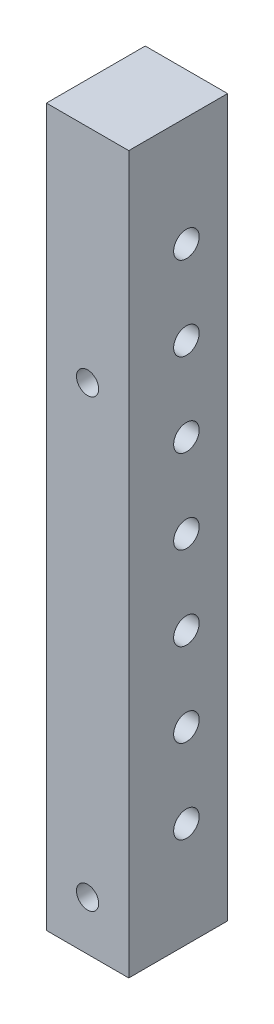
ISO-10303-21;
HEADER;
FILE_DESCRIPTION(('STEP AP214'),'2;1');
FILE_NAME('part.step','',(''),(''),'','','');
FILE_SCHEMA(('AUTOMOTIVE_DESIGN { 1 0 10303 214 1 1 1 1 }'));
ENDSEC;
DATA;
#1=APPLICATION_CONTEXT('core data for automotive mechanical design processes');
#2=APPLICATION_PROTOCOL_DEFINITION('international standard','automotive_design',2000,#1);
#3=PRODUCT_CONTEXT('',#1,'mechanical');
#4=PRODUCT('Part','Part','',(#3));
#5=PRODUCT_RELATED_PRODUCT_CATEGORY('part','',(#4));
#6=PRODUCT_DEFINITION_FORMATION('','',#4);
#7=PRODUCT_DEFINITION_CONTEXT('part definition',#1,'design');
#8=PRODUCT_DEFINITION('design','',#6,#7);
#9=PRODUCT_DEFINITION_SHAPE('','',#8);
#10=(LENGTH_UNIT() NAMED_UNIT(*) SI_UNIT(.MILLI.,.METRE.));
#11=(NAMED_UNIT(*) PLANE_ANGLE_UNIT() SI_UNIT($,.RADIAN.));
#12=(NAMED_UNIT(*) SI_UNIT($,.STERADIAN.) SOLID_ANGLE_UNIT());
#13=UNCERTAINTY_MEASURE_WITH_UNIT(LENGTH_MEASURE(1.E-05),#10,'distance_accuracy_value','');
#14=(GEOMETRIC_REPRESENTATION_CONTEXT(3) GLOBAL_UNCERTAINTY_ASSIGNED_CONTEXT((#13)) GLOBAL_UNIT_ASSIGNED_CONTEXT((#10,
#11,#12)) REPRESENTATION_CONTEXT('',''));
#15=CARTESIAN_POINT('',(0.,0.,0.));
#16=DIRECTION('',(0.,0.,1.));
#17=DIRECTION('',(1.,0.,0.));
#18=AXIS2_PLACEMENT_3D('',#15,#16,#17);
#19=CARTESIAN_POINT('',(-5.,0.,-6.));
#20=DIRECTION('',(0.,0.,-1.));
#21=DIRECTION('',(-1.,0.,0.));
#22=AXIS2_PLACEMENT_3D('',#19,#20,#21);
#23=PLANE('',#22);
#24=DIRECTION('',(0.,1.,0.));
#25=VECTOR('',#24,1.);
#26=CARTESIAN_POINT('',(5.,0.,-6.));
#27=LINE('',#26,#25);
#28=CARTESIAN_POINT('',(5.,0.,-6.));
#29=VERTEX_POINT('',#28);
#30=CARTESIAN_POINT('',(5.,87.,-6.));
#31=VERTEX_POINT('',#30);
#32=EDGE_CURVE('E88',#29,#31,#27,.T.);
#33=ORIENTED_EDGE('',*,*,#32,.F.);
#34=DIRECTION('',(1.,0.,0.));
#35=VECTOR('',#34,1.);
#36=CARTESIAN_POINT('',(-5.,0.,-6.));
#37=LINE('',#36,#35);
#38=CARTESIAN_POINT('',(-5.,0.,-6.));
#39=VERTEX_POINT('',#38);
#40=EDGE_CURVE('E83',#39,#29,#37,.T.);
#41=ORIENTED_EDGE('',*,*,#40,.F.);
#42=DIRECTION('',(0.,1.,0.));
#43=VECTOR('',#42,1.);
#44=CARTESIAN_POINT('',(-5.,0.,-6.));
#45=LINE('',#44,#43);
#46=CARTESIAN_POINT('',(-5.,87.,-6.));
#47=VERTEX_POINT('',#46);
#48=EDGE_CURVE('E86',#39,#47,#45,.T.);
#49=ORIENTED_EDGE('',*,*,#48,.T.);
#50=DIRECTION('',(1.,0.,0.));
#51=VECTOR('',#50,1.);
#52=CARTESIAN_POINT('',(-5.,87.,-6.));
#53=LINE('',#52,#51);
#54=EDGE_CURVE('E47',#47,#31,#53,.T.);
#55=ORIENTED_EDGE('',*,*,#54,.T.);
#56=EDGE_LOOP('',(#33,#41,#49,#55));
#57=FACE_BOUND('',#56,.T.);
#58=CARTESIAN_POINT('',(0.,6.,-6.));
#59=DIRECTION('',(0.,0.,1.));
#60=DIRECTION('',(1.,0.,0.));
#61=AXIS2_PLACEMENT_3D('',#58,#59,#60);
#62=CIRCLE('',#61,1.34999999999999);
#63=CARTESIAN_POINT('',(1.34999999999998,6.,-6.));
#64=VERTEX_POINT('',#63);
#65=EDGE_CURVE('E249',#64,#64,#62,.T.);
#66=ORIENTED_EDGE('',*,*,#65,.T.);
#67=EDGE_LOOP('',(#66));
#68=FACE_BOUND('',#67,.T.);
#69=CARTESIAN_POINT('',(0.,60.1,-6.));
#70=DIRECTION('',(0.,0.,1.));
#71=DIRECTION('',(1.,0.,0.));
#72=AXIS2_PLACEMENT_3D('',#69,#70,#71);
#73=CIRCLE('',#72,1.34999999999999);
#74=CARTESIAN_POINT('',(1.34999999999998,60.1,-6.));
#75=VERTEX_POINT('',#74);
#76=EDGE_CURVE('E255',#75,#75,#73,.T.);
#77=ORIENTED_EDGE('',*,*,#76,.T.);
#78=EDGE_LOOP('',(#77));
#79=FACE_BOUND('',#78,.T.);
#80=ADVANCED_FACE('F37',(#57,#68,#79),#23,.T.);
#81=CARTESIAN_POINT('',(-5.,87.,6.));
#82=DIRECTION('',(0.,0.,1.));
#83=DIRECTION('',(1.,0.,0.));
#84=AXIS2_PLACEMENT_3D('',#81,#82,#83);
#85=PLANE('',#84);
#86=CARTESIAN_POINT('',(0.,60.1,6.));
#87=DIRECTION('',(0.,0.,1.));
#88=DIRECTION('',(1.,0.,0.));
#89=AXIS2_PLACEMENT_3D('',#86,#87,#88);
#90=CIRCLE('',#89,1.34999999999999);
#91=CARTESIAN_POINT('',(1.34999999999999,60.1,6.));
#92=VERTEX_POINT('',#91);
#93=EDGE_CURVE('E258',#92,#92,#90,.T.);
#94=ORIENTED_EDGE('',*,*,#93,.F.);
#95=EDGE_LOOP('',(#94));
#96=FACE_BOUND('',#95,.T.);
#97=CARTESIAN_POINT('',(0.,6.,6.));
#98=DIRECTION('',(0.,0.,1.));
#99=DIRECTION('',(1.,0.,0.));
#100=AXIS2_PLACEMENT_3D('',#97,#98,#99);
#101=CIRCLE('',#100,1.34999999999999);
#102=CARTESIAN_POINT('',(1.34999999999999,6.,6.));
#103=VERTEX_POINT('',#102);
#104=EDGE_CURVE('E252',#103,#103,#101,.T.);
#105=ORIENTED_EDGE('',*,*,#104,.F.);
#106=EDGE_LOOP('',(#105));
#107=FACE_BOUND('',#106,.T.);
#108=DIRECTION('',(0.,-1.,0.));
#109=VECTOR('',#108,1.);
#110=CARTESIAN_POINT('',(5.,87.,6.));
#111=LINE('',#110,#109);
#112=CARTESIAN_POINT('',(5.,87.,6.));
#113=VERTEX_POINT('',#112);
#114=CARTESIAN_POINT('',(5.,0.,6.));
#115=VERTEX_POINT('',#114);
#116=EDGE_CURVE('E103',#113,#115,#111,.T.);
#117=ORIENTED_EDGE('',*,*,#116,.F.);
#118=DIRECTION('',(1.,0.,0.));
#119=VECTOR('',#118,1.);
#120=CARTESIAN_POINT('',(-5.,87.,6.));
#121=LINE('',#120,#119);
#122=CARTESIAN_POINT('',(-5.,87.,6.));
#123=VERTEX_POINT('',#122);
#124=EDGE_CURVE('E11',#123,#113,#121,.T.);
#125=ORIENTED_EDGE('',*,*,#124,.F.);
#126=DIRECTION('',(0.,-1.,0.));
#127=VECTOR('',#126,1.);
#128=CARTESIAN_POINT('',(-5.,87.,6.));
#129=LINE('',#128,#127);
#130=CARTESIAN_POINT('',(-5.,0.,6.));
#131=VERTEX_POINT('',#130);
#132=EDGE_CURVE('E96',#123,#131,#129,.T.);
#133=ORIENTED_EDGE('',*,*,#132,.T.);
#134=DIRECTION('',(1.,0.,0.));
#135=VECTOR('',#134,1.);
#136=CARTESIAN_POINT('',(-5.,0.,6.));
#137=LINE('',#136,#135);
#138=EDGE_CURVE('E41',#131,#115,#137,.T.);
#139=ORIENTED_EDGE('',*,*,#138,.T.);
#140=EDGE_LOOP('',(#117,#125,#133,#139));
#141=FACE_BOUND('',#140,.T.);
#142=ADVANCED_FACE('F39',(#96,#107,#141),#85,.T.);
#143=CARTESIAN_POINT('',(-5.,87.,-6.));
#144=DIRECTION('',(0.,1.,0.));
#145=DIRECTION('',(0.,0.,1.));
#146=AXIS2_PLACEMENT_3D('',#143,#144,#145);
#147=PLANE('',#146);
#148=DIRECTION('',(0.,0.,1.));
#149=VECTOR('',#148,1.);
#150=CARTESIAN_POINT('',(5.,87.,-6.));
#151=LINE('',#150,#149);
#152=EDGE_CURVE('E98',#31,#113,#151,.T.);
#153=ORIENTED_EDGE('',*,*,#152,.F.);
#154=ORIENTED_EDGE('',*,*,#54,.F.);
#155=DIRECTION('',(0.,0.,1.));
#156=VECTOR('',#155,1.);
#157=CARTESIAN_POINT('',(-5.,87.,-6.));
#158=LINE('',#157,#156);
#159=EDGE_CURVE('E93',#47,#123,#158,.T.);
#160=ORIENTED_EDGE('',*,*,#159,.T.);
#161=ORIENTED_EDGE('',*,*,#124,.T.);
#162=EDGE_LOOP('',(#153,#154,#160,#161));
#163=FACE_BOUND('',#162,.T.);
#164=ADVANCED_FACE('F114',(#163),#147,.T.);
#165=CARTESIAN_POINT('',(-5.,0.,6.));
#166=DIRECTION('',(0.,-1.,0.));
#167=DIRECTION('',(0.,0.,-1.));
#168=AXIS2_PLACEMENT_3D('',#165,#166,#167);
#169=PLANE('',#168);
#170=DIRECTION('',(0.,0.,-1.));
#171=VECTOR('',#170,1.);
#172=CARTESIAN_POINT('',(5.,0.,6.));
#173=LINE('',#172,#171);
#174=EDGE_CURVE('E106',#115,#29,#173,.T.);
#175=ORIENTED_EDGE('',*,*,#174,.F.);
#176=ORIENTED_EDGE('',*,*,#138,.F.);
#177=DIRECTION('',(0.,0.,-1.));
#178=VECTOR('',#177,1.);
#179=CARTESIAN_POINT('',(-5.,0.,6.));
#180=LINE('',#179,#178);
#181=EDGE_CURVE('E92',#131,#39,#180,.T.);
#182=ORIENTED_EDGE('',*,*,#181,.T.);
#183=ORIENTED_EDGE('',*,*,#40,.T.);
#184=EDGE_LOOP('',(#175,#176,#182,#183));
#185=FACE_BOUND('',#184,.T.);
#186=ADVANCED_FACE('F95',(#185),#169,.T.);
#187=CARTESIAN_POINT('',(-5.,0.,0.));
#188=DIRECTION('',(1.,0.,0.));
#189=DIRECTION('',(0.,0.,-1.));
#190=AXIS2_PLACEMENT_3D('',#187,#188,#189);
#191=PLANE('',#190);
#192=CARTESIAN_POINT('',(-4.99999999999999,63.53,-1.00000000000017));
#193=DIRECTION('',(1.,0.,0.));
#194=DIRECTION('',(0.,0.,-1.));
#195=AXIS2_PLACEMENT_3D('',#192,#193,#194);
#196=CIRCLE('',#195,1.54999999999998);
#197=CARTESIAN_POINT('',(-4.99999999999999,63.53,-2.55000000000016));
#198=VERTEX_POINT('',#197);
#199=EDGE_CURVE('E245',#198,#198,#196,.T.);
#200=ORIENTED_EDGE('',*,*,#199,.T.);
#201=EDGE_LOOP('',(#200));
#202=FACE_BOUND('',#201,.T.);
#203=CARTESIAN_POINT('',(-4.99999999999999,43.21,-1.0000000000001));
#204=DIRECTION('',(1.,0.,0.));
#205=DIRECTION('',(0.,0.,-1.));
#206=AXIS2_PLACEMENT_3D('',#203,#204,#205);
#207=CIRCLE('',#206,1.54999999999999);
#208=CARTESIAN_POINT('',(-4.99999999999999,43.21,-2.55000000000009));
#209=VERTEX_POINT('',#208);
#210=EDGE_CURVE('E241',#209,#209,#207,.T.);
#211=ORIENTED_EDGE('',*,*,#210,.T.);
#212=EDGE_LOOP('',(#211));
#213=FACE_BOUND('',#212,.T.);
#214=CARTESIAN_POINT('',(-4.99999999999999,22.89,-1.00000000000003));
#215=DIRECTION('',(1.,0.,0.));
#216=DIRECTION('',(0.,0.,-1.));
#217=AXIS2_PLACEMENT_3D('',#214,#215,#216);
#218=CIRCLE('',#217,1.54999999999999);
#219=CARTESIAN_POINT('',(-4.99999999999999,22.89,-2.55000000000002));
#220=VERTEX_POINT('',#219);
#221=EDGE_CURVE('E237',#220,#220,#218,.T.);
#222=ORIENTED_EDGE('',*,*,#221,.T.);
#223=EDGE_LOOP('',(#222));
#224=FACE_BOUND('',#223,.T.);
#225=CARTESIAN_POINT('',(-4.99999999999999,53.37,-1.00000000000014));
#226=DIRECTION('',(1.,0.,0.));
#227=DIRECTION('',(0.,0.,-1.));
#228=AXIS2_PLACEMENT_3D('',#225,#226,#227);
#229=CIRCLE('',#228,1.54999999999999);
#230=CARTESIAN_POINT('',(-4.99999999999999,53.37,-2.55000000000013));
#231=VERTEX_POINT('',#230);
#232=EDGE_CURVE('E233',#231,#231,#229,.T.);
#233=ORIENTED_EDGE('',*,*,#232,.T.);
#234=EDGE_LOOP('',(#233));
#235=FACE_BOUND('',#234,.T.);
#236=CARTESIAN_POINT('',(-4.99999999999999,33.05,-1.00000000000007));
#237=DIRECTION('',(1.,0.,0.));
#238=DIRECTION('',(0.,0.,-1.));
#239=AXIS2_PLACEMENT_3D('',#236,#237,#238);
#240=CIRCLE('',#239,1.54999999999999);
#241=CARTESIAN_POINT('',(-4.99999999999999,33.05,-2.55000000000006));
#242=VERTEX_POINT('',#241);
#243=EDGE_CURVE('E229',#242,#242,#240,.T.);
#244=ORIENTED_EDGE('',*,*,#243,.T.);
#245=EDGE_LOOP('',(#244));
#246=FACE_BOUND('',#245,.T.);
#247=CARTESIAN_POINT('',(-4.99999999999999,12.73,-1.));
#248=DIRECTION('',(1.,0.,0.));
#249=DIRECTION('',(0.,0.,-1.));
#250=AXIS2_PLACEMENT_3D('',#247,#248,#249);
#251=CIRCLE('',#250,1.54999999999999);
#252=CARTESIAN_POINT('',(-4.99999999999999,12.73,-2.54999999999999));
#253=VERTEX_POINT('',#252);
#254=EDGE_CURVE('E222',#253,#253,#251,.T.);
#255=ORIENTED_EDGE('',*,*,#254,.T.);
#256=EDGE_LOOP('',(#255));
#257=FACE_BOUND('',#256,.T.);
#258=CARTESIAN_POINT('',(-4.99999999999999,73.69,-1.00000000000021));
#259=DIRECTION('',(1.,0.,0.));
#260=DIRECTION('',(0.,0.,-1.));
#261=AXIS2_PLACEMENT_3D('',#258,#259,#260);
#262=CIRCLE('',#261,1.54999999999998);
#263=CARTESIAN_POINT('',(-4.99999999999999,73.69,-2.55000000000019));
#264=VERTEX_POINT('',#263);
#265=EDGE_CURVE('E107',#264,#264,#262,.T.);
#266=ORIENTED_EDGE('',*,*,#265,.T.);
#267=EDGE_LOOP('',(#266));
#268=FACE_BOUND('',#267,.T.);
#269=ORIENTED_EDGE('',*,*,#132,.F.);
#270=ORIENTED_EDGE('',*,*,#159,.F.);
#271=ORIENTED_EDGE('',*,*,#48,.F.);
#272=ORIENTED_EDGE('',*,*,#181,.F.);
#273=EDGE_LOOP('',(#269,#270,#271,#272));
#274=FACE_BOUND('',#273,.T.);
#275=ADVANCED_FACE('F91',(#202,#213,#224,#235,#246,#257,#268,#274),#191,.F.);
#276=CARTESIAN_POINT('',(5.,0.,0.));
#277=DIRECTION('',(1.,0.,0.));
#278=DIRECTION('',(0.,0.,-1.));
#279=AXIS2_PLACEMENT_3D('',#276,#277,#278);
#280=PLANE('',#279);
#281=CARTESIAN_POINT('',(5.,63.53,-1.00000000000017));
#282=DIRECTION('',(1.,0.,0.));
#283=DIRECTION('',(0.,0.,-1.));
#284=AXIS2_PLACEMENT_3D('',#281,#282,#283);
#285=CIRCLE('',#284,1.54999999999998);
#286=CARTESIAN_POINT('',(5.,63.53,-2.55000000000016));
#287=VERTEX_POINT('',#286);
#288=EDGE_CURVE('E197',#287,#287,#285,.T.);
#289=ORIENTED_EDGE('',*,*,#288,.F.);
#290=EDGE_LOOP('',(#289));
#291=FACE_BOUND('',#290,.T.);
#292=CARTESIAN_POINT('',(5.,43.21,-1.0000000000001));
#293=DIRECTION('',(1.,0.,0.));
#294=DIRECTION('',(0.,0.,-1.));
#295=AXIS2_PLACEMENT_3D('',#292,#293,#294);
#296=CIRCLE('',#295,1.54999999999999);
#297=CARTESIAN_POINT('',(5.,43.21,-2.55000000000009));
#298=VERTEX_POINT('',#297);
#299=EDGE_CURVE('E201',#298,#298,#296,.T.);
#300=ORIENTED_EDGE('',*,*,#299,.F.);
#301=EDGE_LOOP('',(#300));
#302=FACE_BOUND('',#301,.T.);
#303=CARTESIAN_POINT('',(5.,22.89,-1.00000000000003));
#304=DIRECTION('',(1.,0.,0.));
#305=DIRECTION('',(0.,0.,-1.));
#306=AXIS2_PLACEMENT_3D('',#303,#304,#305);
#307=CIRCLE('',#306,1.54999999999999);
#308=CARTESIAN_POINT('',(5.,22.89,-2.55000000000002));
#309=VERTEX_POINT('',#308);
#310=EDGE_CURVE('E205',#309,#309,#307,.T.);
#311=ORIENTED_EDGE('',*,*,#310,.F.);
#312=EDGE_LOOP('',(#311));
#313=FACE_BOUND('',#312,.T.);
#314=CARTESIAN_POINT('',(5.,53.37,-1.00000000000014));
#315=DIRECTION('',(1.,0.,0.));
#316=DIRECTION('',(0.,0.,-1.));
#317=AXIS2_PLACEMENT_3D('',#314,#315,#316);
#318=CIRCLE('',#317,1.54999999999999);
#319=CARTESIAN_POINT('',(5.,53.37,-2.55000000000013));
#320=VERTEX_POINT('',#319);
#321=EDGE_CURVE('E209',#320,#320,#318,.T.);
#322=ORIENTED_EDGE('',*,*,#321,.F.);
#323=EDGE_LOOP('',(#322));
#324=FACE_BOUND('',#323,.T.);
#325=CARTESIAN_POINT('',(5.,33.05,-1.00000000000007));
#326=DIRECTION('',(1.,0.,0.));
#327=DIRECTION('',(0.,0.,-1.));
#328=AXIS2_PLACEMENT_3D('',#325,#326,#327);
#329=CIRCLE('',#328,1.54999999999999);
#330=CARTESIAN_POINT('',(5.,33.05,-2.55000000000006));
#331=VERTEX_POINT('',#330);
#332=EDGE_CURVE('E213',#331,#331,#329,.T.);
#333=ORIENTED_EDGE('',*,*,#332,.F.);
#334=EDGE_LOOP('',(#333));
#335=FACE_BOUND('',#334,.T.);
#336=CARTESIAN_POINT('',(5.,12.73,-1.));
#337=DIRECTION('',(1.,0.,0.));
#338=DIRECTION('',(0.,0.,-1.));
#339=AXIS2_PLACEMENT_3D('',#336,#337,#338);
#340=CIRCLE('',#339,1.54999999999999);
#341=CARTESIAN_POINT('',(5.,12.73,-2.54999999999999));
#342=VERTEX_POINT('',#341);
#343=EDGE_CURVE('E217',#342,#342,#340,.T.);
#344=ORIENTED_EDGE('',*,*,#343,.F.);
#345=EDGE_LOOP('',(#344));
#346=FACE_BOUND('',#345,.T.);
#347=CARTESIAN_POINT('',(5.,73.69,-1.00000000000021));
#348=DIRECTION('',(1.,0.,0.));
#349=DIRECTION('',(0.,0.,-1.));
#350=AXIS2_PLACEMENT_3D('',#347,#348,#349);
#351=CIRCLE('',#350,1.54999999999998);
#352=CARTESIAN_POINT('',(5.,73.69,-2.55000000000019));
#353=VERTEX_POINT('',#352);
#354=EDGE_CURVE('E220',#353,#353,#351,.T.);
#355=ORIENTED_EDGE('',*,*,#354,.F.);
#356=EDGE_LOOP('',(#355));
#357=FACE_BOUND('',#356,.T.);
#358=ORIENTED_EDGE('',*,*,#116,.T.);
#359=ORIENTED_EDGE('',*,*,#174,.T.);
#360=ORIENTED_EDGE('',*,*,#32,.T.);
#361=ORIENTED_EDGE('',*,*,#152,.T.);
#362=EDGE_LOOP('',(#358,#359,#360,#361));
#363=FACE_BOUND('',#362,.T.);
#364=ADVANCED_FACE('F113',(#291,#302,#313,#324,#335,#346,#357,#363),#280,.T.);
#365=CARTESIAN_POINT('',(5.,73.69,-1.00000000000021));
#366=DIRECTION('',(1.,0.,0.));
#367=DIRECTION('',(0.,0.,-1.));
#368=AXIS2_PLACEMENT_3D('',#365,#366,#367);
#369=CYLINDRICAL_SURFACE('',#368,1.54999999999998);
#370=ORIENTED_EDGE('',*,*,#265,.F.);
#371=EDGE_LOOP('',(#370));
#372=FACE_BOUND('',#371,.T.);
#373=ORIENTED_EDGE('',*,*,#354,.T.);
#374=EDGE_LOOP('',(#373));
#375=FACE_BOUND('',#374,.T.);
#376=ADVANCED_FACE('F183',(#372,#375),#369,.F.);
#377=CARTESIAN_POINT('',(5.,12.73,-1.));
#378=DIRECTION('',(1.,0.,0.));
#379=DIRECTION('',(0.,0.,-1.));
#380=AXIS2_PLACEMENT_3D('',#377,#378,#379);
#381=CYLINDRICAL_SURFACE('',#380,1.54999999999999);
#382=ORIENTED_EDGE('',*,*,#254,.F.);
#383=EDGE_LOOP('',(#382));
#384=FACE_BOUND('',#383,.T.);
#385=ORIENTED_EDGE('',*,*,#343,.T.);
#386=EDGE_LOOP('',(#385));
#387=FACE_BOUND('',#386,.T.);
#388=ADVANCED_FACE('F179',(#384,#387),#381,.F.);
#389=CARTESIAN_POINT('',(5.,33.05,-1.00000000000007));
#390=DIRECTION('',(1.,0.,0.));
#391=DIRECTION('',(0.,0.,-1.));
#392=AXIS2_PLACEMENT_3D('',#389,#390,#391);
#393=CYLINDRICAL_SURFACE('',#392,1.54999999999999);
#394=ORIENTED_EDGE('',*,*,#243,.F.);
#395=EDGE_LOOP('',(#394));
#396=FACE_BOUND('',#395,.T.);
#397=ORIENTED_EDGE('',*,*,#332,.T.);
#398=EDGE_LOOP('',(#397));
#399=FACE_BOUND('',#398,.T.);
#400=ADVANCED_FACE('F175',(#396,#399),#393,.F.);
#401=CARTESIAN_POINT('',(5.,53.37,-1.00000000000014));
#402=DIRECTION('',(1.,0.,0.));
#403=DIRECTION('',(0.,0.,-1.));
#404=AXIS2_PLACEMENT_3D('',#401,#402,#403);
#405=CYLINDRICAL_SURFACE('',#404,1.54999999999999);
#406=ORIENTED_EDGE('',*,*,#232,.F.);
#407=EDGE_LOOP('',(#406));
#408=FACE_BOUND('',#407,.T.);
#409=ORIENTED_EDGE('',*,*,#321,.T.);
#410=EDGE_LOOP('',(#409));
#411=FACE_BOUND('',#410,.T.);
#412=ADVANCED_FACE('F171',(#408,#411),#405,.F.);
#413=CARTESIAN_POINT('',(5.,22.89,-1.00000000000003));
#414=DIRECTION('',(1.,0.,0.));
#415=DIRECTION('',(0.,0.,-1.));
#416=AXIS2_PLACEMENT_3D('',#413,#414,#415);
#417=CYLINDRICAL_SURFACE('',#416,1.54999999999999);
#418=ORIENTED_EDGE('',*,*,#221,.F.);
#419=EDGE_LOOP('',(#418));
#420=FACE_BOUND('',#419,.T.);
#421=ORIENTED_EDGE('',*,*,#310,.T.);
#422=EDGE_LOOP('',(#421));
#423=FACE_BOUND('',#422,.T.);
#424=ADVANCED_FACE('F167',(#420,#423),#417,.F.);
#425=CARTESIAN_POINT('',(5.,43.21,-1.0000000000001));
#426=DIRECTION('',(1.,0.,0.));
#427=DIRECTION('',(0.,0.,-1.));
#428=AXIS2_PLACEMENT_3D('',#425,#426,#427);
#429=CYLINDRICAL_SURFACE('',#428,1.54999999999999);
#430=ORIENTED_EDGE('',*,*,#210,.F.);
#431=EDGE_LOOP('',(#430));
#432=FACE_BOUND('',#431,.T.);
#433=ORIENTED_EDGE('',*,*,#299,.T.);
#434=EDGE_LOOP('',(#433));
#435=FACE_BOUND('',#434,.T.);
#436=ADVANCED_FACE('F163',(#432,#435),#429,.F.);
#437=CARTESIAN_POINT('',(5.,63.53,-1.00000000000017));
#438=DIRECTION('',(1.,0.,0.));
#439=DIRECTION('',(0.,0.,-1.));
#440=AXIS2_PLACEMENT_3D('',#437,#438,#439);
#441=CYLINDRICAL_SURFACE('',#440,1.54999999999998);
#442=ORIENTED_EDGE('',*,*,#199,.F.);
#443=EDGE_LOOP('',(#442));
#444=FACE_BOUND('',#443,.T.);
#445=ORIENTED_EDGE('',*,*,#288,.T.);
#446=EDGE_LOOP('',(#445));
#447=FACE_BOUND('',#446,.T.);
#448=ADVANCED_FACE('F144',(#444,#447),#441,.F.);
#449=CARTESIAN_POINT('',(0.,6.,6.));
#450=DIRECTION('',(0.,0.,1.));
#451=DIRECTION('',(1.,0.,0.));
#452=AXIS2_PLACEMENT_3D('',#449,#450,#451);
#453=CYLINDRICAL_SURFACE('',#452,1.34999999999999);
#454=ORIENTED_EDGE('',*,*,#65,.F.);
#455=EDGE_LOOP('',(#454));
#456=FACE_BOUND('',#455,.T.);
#457=ORIENTED_EDGE('',*,*,#104,.T.);
#458=EDGE_LOOP('',(#457));
#459=FACE_BOUND('',#458,.T.);
#460=ADVANCED_FACE('F138',(#456,#459),#453,.F.);
#461=CARTESIAN_POINT('',(0.,60.1,6.));
#462=DIRECTION('',(0.,0.,1.));
#463=DIRECTION('',(1.,0.,0.));
#464=AXIS2_PLACEMENT_3D('',#461,#462,#463);
#465=CYLINDRICAL_SURFACE('',#464,1.34999999999999);
#466=ORIENTED_EDGE('',*,*,#76,.F.);
#467=EDGE_LOOP('',(#466));
#468=FACE_BOUND('',#467,.T.);
#469=ORIENTED_EDGE('',*,*,#93,.T.);
#470=EDGE_LOOP('',(#469));
#471=FACE_BOUND('',#470,.T.);
#472=ADVANCED_FACE('F143',(#468,#471),#465,.F.);
#473=CLOSED_SHELL('',(#80,#142,#164,#186,#275,#364,#376,#388,#400,#412,#424,#436,#448,#460,#472));
#474=MANIFOLD_SOLID_BREP('B2',#473);
#475=ADVANCED_BREP_SHAPE_REPRESENTATION('',(#18,#474),#14);
#476=SHAPE_DEFINITION_REPRESENTATION(#9,#475);
ENDSEC;
END-ISO-10303-21;
